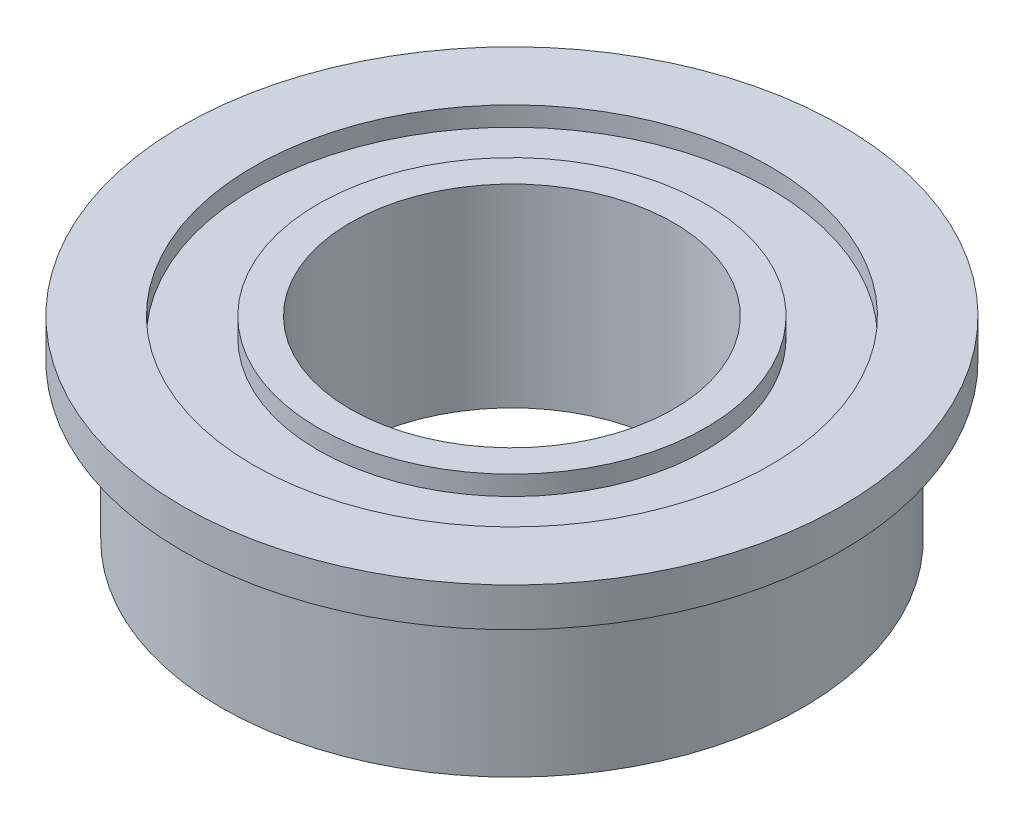
ISO-10303-21;
HEADER;
FILE_DESCRIPTION(('STEP AP214'),'2;1');
FILE_NAME('part.step','',(''),(''),'','','');
FILE_SCHEMA(('AUTOMOTIVE_DESIGN { 1 0 10303 214 1 1 1 1 }'));
ENDSEC;
DATA;
#1=APPLICATION_CONTEXT('core data for automotive mechanical design processes');
#2=APPLICATION_PROTOCOL_DEFINITION('international standard','automotive_design',2000,#1);
#3=PRODUCT_CONTEXT('',#1,'mechanical');
#4=PRODUCT('Part','Part','',(#3));
#5=PRODUCT_RELATED_PRODUCT_CATEGORY('part','',(#4));
#6=PRODUCT_DEFINITION_FORMATION('','',#4);
#7=PRODUCT_DEFINITION_CONTEXT('part definition',#1,'design');
#8=PRODUCT_DEFINITION('design','',#6,#7);
#9=PRODUCT_DEFINITION_SHAPE('','',#8);
#10=(LENGTH_UNIT() NAMED_UNIT(*) SI_UNIT(.MILLI.,.METRE.));
#11=(NAMED_UNIT(*) PLANE_ANGLE_UNIT() SI_UNIT($,.RADIAN.));
#12=(NAMED_UNIT(*) SI_UNIT($,.STERADIAN.) SOLID_ANGLE_UNIT());
#13=UNCERTAINTY_MEASURE_WITH_UNIT(LENGTH_MEASURE(1.E-05),#10,'distance_accuracy_value','');
#14=(GEOMETRIC_REPRESENTATION_CONTEXT(3) GLOBAL_UNCERTAINTY_ASSIGNED_CONTEXT((#13)) GLOBAL_UNIT_ASSIGNED_CONTEXT((#10,
#11,#12)) REPRESENTATION_CONTEXT('',''));
#15=CARTESIAN_POINT('',(0.,0.,0.));
#16=DIRECTION('',(0.,0.,1.));
#17=DIRECTION('',(1.,0.,0.));
#18=AXIS2_PLACEMENT_3D('',#15,#16,#17);
#19=CARTESIAN_POINT('',(0.,-1.5,0.));
#20=DIRECTION('',(0.,1.,0.));
#21=DIRECTION('',(0.,0.,1.));
#22=AXIS2_PLACEMENT_3D('',#19,#20,#21);
#23=CYLINDRICAL_SURFACE('',#22,4.5);
#24=CARTESIAN_POINT('',(0.,-1.5,0.));
#25=DIRECTION('',(0.,1.,0.));
#26=DIRECTION('',(0.,0.,1.));
#27=AXIS2_PLACEMENT_3D('',#24,#25,#26);
#28=CIRCLE('',#27,4.5);
#29=CARTESIAN_POINT('',(0.,-1.5,4.5));
#30=VERTEX_POINT('',#29);
#31=EDGE_CURVE('E56',#30,#30,#28,.T.);
#32=ORIENTED_EDGE('',*,*,#31,.T.);
#33=EDGE_LOOP('',(#32));
#34=FACE_BOUND('',#33,.T.);
#35=CARTESIAN_POINT('',(0.,0.9,0.));
#36=DIRECTION('',(0.,1.,0.));
#37=DIRECTION('',(0.,0.,1.));
#38=AXIS2_PLACEMENT_3D('',#35,#36,#37);
#39=CIRCLE('',#38,4.5);
#40=CARTESIAN_POINT('',(0.,0.9,4.5));
#41=VERTEX_POINT('',#40);
#42=EDGE_CURVE('E94',#41,#41,#39,.T.);
#43=ORIENTED_EDGE('',*,*,#42,.F.);
#44=EDGE_LOOP('',(#43));
#45=FACE_BOUND('',#44,.T.);
#46=ADVANCED_FACE('F49',(#34,#45),#23,.T.);
#47=CARTESIAN_POINT('',(0.,-1.5,0.));
#48=DIRECTION('',(0.,1.,0.));
#49=DIRECTION('',(0.,0.,1.));
#50=AXIS2_PLACEMENT_3D('',#47,#48,#49);
#51=CYLINDRICAL_SURFACE('',#50,4.);
#52=CARTESIAN_POINT('',(0.,-1.5,0.));
#53=DIRECTION('',(0.,1.,0.));
#54=DIRECTION('',(0.,0.,1.));
#55=AXIS2_PLACEMENT_3D('',#52,#53,#54);
#56=CIRCLE('',#55,4.);
#57=CARTESIAN_POINT('',(0.,-1.5,4.));
#58=VERTEX_POINT('',#57);
#59=EDGE_CURVE('E60',#58,#58,#56,.T.);
#60=ORIENTED_EDGE('',*,*,#59,.F.);
#61=EDGE_LOOP('',(#60));
#62=FACE_BOUND('',#61,.T.);
#63=CARTESIAN_POINT('',(0.,-1.2,0.));
#64=DIRECTION('',(0.,1.,0.));
#65=DIRECTION('',(0.,0.,1.));
#66=AXIS2_PLACEMENT_3D('',#63,#64,#65);
#67=CIRCLE('',#66,4.);
#68=CARTESIAN_POINT('',(0.,-1.2,4.));
#69=VERTEX_POINT('',#68);
#70=EDGE_CURVE('E11',#69,#69,#67,.F.);
#71=ORIENTED_EDGE('',*,*,#70,.F.);
#72=EDGE_LOOP('',(#71));
#73=FACE_BOUND('',#72,.T.);
#74=ADVANCED_FACE('F104',(#62,#73),#51,.F.);
#75=CARTESIAN_POINT('',(0.,1.2,0.));
#76=DIRECTION('',(0.,1.,0.));
#77=DIRECTION('',(0.,0.,1.));
#78=AXIS2_PLACEMENT_3D('',#75,#76,#77);
#79=CIRCLE('',#78,4.);
#80=CARTESIAN_POINT('',(0.,1.2,4.));
#81=VERTEX_POINT('',#80);
#82=EDGE_CURVE('E69',#81,#81,#79,.T.);
#83=ORIENTED_EDGE('',*,*,#82,.F.);
#84=EDGE_LOOP('',(#83));
#85=FACE_BOUND('',#84,.T.);
#86=CARTESIAN_POINT('',(0.,1.5,0.));
#87=DIRECTION('',(0.,1.,0.));
#88=DIRECTION('',(0.,0.,1.));
#89=AXIS2_PLACEMENT_3D('',#86,#87,#88);
#90=CIRCLE('',#89,4.);
#91=CARTESIAN_POINT('',(0.,1.5,4.));
#92=VERTEX_POINT('',#91);
#93=EDGE_CURVE('E64',#92,#92,#90,.T.);
#94=ORIENTED_EDGE('',*,*,#93,.T.);
#95=EDGE_LOOP('',(#94));
#96=FACE_BOUND('',#95,.T.);
#97=ADVANCED_FACE('F51',(#85,#96),#51,.F.);
#98=CARTESIAN_POINT('',(0.,-1.5,0.));
#99=DIRECTION('',(0.,1.,0.));
#100=DIRECTION('',(0.,0.,1.));
#101=AXIS2_PLACEMENT_3D('',#98,#99,#100);
#102=PLANE('',#101);
#103=ORIENTED_EDGE('',*,*,#59,.T.);
#104=EDGE_LOOP('',(#103));
#105=FACE_BOUND('',#104,.T.);
#106=ORIENTED_EDGE('',*,*,#31,.F.);
#107=EDGE_LOOP('',(#106));
#108=FACE_BOUND('',#107,.T.);
#109=ADVANCED_FACE('F112',(#105,#108),#102,.F.);
#110=CARTESIAN_POINT('',(0.,1.5,0.));
#111=DIRECTION('',(0.,1.,0.));
#112=DIRECTION('',(0.,0.,1.));
#113=AXIS2_PLACEMENT_3D('',#110,#111,#112);
#114=PLANE('',#113);
#115=ORIENTED_EDGE('',*,*,#93,.F.);
#116=EDGE_LOOP('',(#115));
#117=FACE_BOUND('',#116,.T.);
#118=CARTESIAN_POINT('',(0.,1.5,0.));
#119=DIRECTION('',(0.,1.,0.));
#120=DIRECTION('',(0.,0.,1.));
#121=AXIS2_PLACEMENT_3D('',#118,#119,#120);
#122=CIRCLE('',#121,5.1);
#123=CARTESIAN_POINT('',(0.,1.5,5.1));
#124=VERTEX_POINT('',#123);
#125=EDGE_CURVE('E91',#124,#124,#122,.T.);
#126=ORIENTED_EDGE('',*,*,#125,.T.);
#127=EDGE_LOOP('',(#126));
#128=FACE_BOUND('',#127,.T.);
#129=ADVANCED_FACE('F115',(#117,#128),#114,.T.);
#130=CARTESIAN_POINT('',(0.,-1.2,0.));
#131=DIRECTION('',(0.,1.,0.));
#132=DIRECTION('',(0.,0.,1.));
#133=AXIS2_PLACEMENT_3D('',#130,#131,#132);
#134=PLANE('',#133);
#135=CARTESIAN_POINT('',(0.,-1.2,0.));
#136=DIRECTION('',(0.,1.,0.));
#137=DIRECTION('',(0.,0.,1.));
#138=AXIS2_PLACEMENT_3D('',#135,#136,#137);
#139=CIRCLE('',#138,3.);
#140=CARTESIAN_POINT('',(0.,-1.2,3.));
#141=VERTEX_POINT('',#140);
#142=EDGE_CURVE('E75',#141,#141,#139,.T.);
#143=ORIENTED_EDGE('',*,*,#142,.T.);
#144=EDGE_LOOP('',(#143));
#145=FACE_BOUND('',#144,.T.);
#146=ORIENTED_EDGE('',*,*,#70,.T.);
#147=EDGE_LOOP('',(#146));
#148=FACE_BOUND('',#147,.T.);
#149=ADVANCED_FACE('F119',(#145,#148),#134,.F.);
#150=CARTESIAN_POINT('',(0.,1.2,0.));
#151=DIRECTION('',(0.,1.,0.));
#152=DIRECTION('',(0.,0.,1.));
#153=AXIS2_PLACEMENT_3D('',#150,#151,#152);
#154=PLANE('',#153);
#155=ORIENTED_EDGE('',*,*,#82,.T.);
#156=EDGE_LOOP('',(#155));
#157=FACE_BOUND('',#156,.T.);
#158=CARTESIAN_POINT('',(0.,1.2,0.));
#159=DIRECTION('',(0.,1.,0.));
#160=DIRECTION('',(0.,0.,1.));
#161=AXIS2_PLACEMENT_3D('',#158,#159,#160);
#162=CIRCLE('',#161,3.);
#163=CARTESIAN_POINT('',(0.,1.2,3.));
#164=VERTEX_POINT('',#163);
#165=EDGE_CURVE('E72',#164,#164,#162,.T.);
#166=ORIENTED_EDGE('',*,*,#165,.F.);
#167=EDGE_LOOP('',(#166));
#168=FACE_BOUND('',#167,.T.);
#169=ADVANCED_FACE('F123',(#157,#168),#154,.T.);
#170=CARTESIAN_POINT('',(0.,-1.5,0.));
#171=DIRECTION('',(0.,1.,0.));
#172=DIRECTION('',(0.,0.,1.));
#173=AXIS2_PLACEMENT_3D('',#170,#171,#172);
#174=CYLINDRICAL_SURFACE('',#173,3.);
#175=CARTESIAN_POINT('',(0.,-1.5,0.));
#176=DIRECTION('',(0.,1.,0.));
#177=DIRECTION('',(0.,0.,1.));
#178=AXIS2_PLACEMENT_3D('',#175,#176,#177);
#179=CIRCLE('',#178,3.);
#180=CARTESIAN_POINT('',(0.,-1.5,3.));
#181=VERTEX_POINT('',#180);
#182=EDGE_CURVE('E78',#181,#181,#179,.T.);
#183=ORIENTED_EDGE('',*,*,#182,.T.);
#184=EDGE_LOOP('',(#183));
#185=FACE_BOUND('',#184,.T.);
#186=ORIENTED_EDGE('',*,*,#142,.F.);
#187=EDGE_LOOP('',(#186));
#188=FACE_BOUND('',#187,.T.);
#189=ADVANCED_FACE('F127',(#185,#188),#174,.T.);
#190=CARTESIAN_POINT('',(0.,-1.5,0.));
#191=DIRECTION('',(0.,1.,0.));
#192=DIRECTION('',(0.,0.,1.));
#193=AXIS2_PLACEMENT_3D('',#190,#191,#192);
#194=CYLINDRICAL_SURFACE('',#193,2.5);
#195=CARTESIAN_POINT('',(0.,-1.5,0.));
#196=DIRECTION('',(0.,1.,0.));
#197=DIRECTION('',(0.,0.,1.));
#198=AXIS2_PLACEMENT_3D('',#195,#196,#197);
#199=CIRCLE('',#198,2.5);
#200=CARTESIAN_POINT('',(0.,-1.5,2.5));
#201=VERTEX_POINT('',#200);
#202=EDGE_CURVE('E81',#201,#201,#199,.T.);
#203=ORIENTED_EDGE('',*,*,#202,.F.);
#204=EDGE_LOOP('',(#203));
#205=FACE_BOUND('',#204,.T.);
#206=CARTESIAN_POINT('',(0.,1.5,0.));
#207=DIRECTION('',(0.,1.,0.));
#208=DIRECTION('',(0.,0.,1.));
#209=AXIS2_PLACEMENT_3D('',#206,#207,#208);
#210=CIRCLE('',#209,2.5);
#211=CARTESIAN_POINT('',(0.,1.5,2.5));
#212=VERTEX_POINT('',#211);
#213=EDGE_CURVE('E87',#212,#212,#210,.T.);
#214=ORIENTED_EDGE('',*,*,#213,.T.);
#215=EDGE_LOOP('',(#214));
#216=FACE_BOUND('',#215,.T.);
#217=ADVANCED_FACE('F129',(#205,#216),#194,.F.);
#218=ORIENTED_EDGE('',*,*,#165,.T.);
#219=EDGE_LOOP('',(#218));
#220=FACE_BOUND('',#219,.T.);
#221=CARTESIAN_POINT('',(0.,1.5,0.));
#222=DIRECTION('',(0.,1.,0.));
#223=DIRECTION('',(0.,0.,1.));
#224=AXIS2_PLACEMENT_3D('',#221,#222,#223);
#225=CIRCLE('',#224,3.);
#226=CARTESIAN_POINT('',(0.,1.5,3.));
#227=VERTEX_POINT('',#226);
#228=EDGE_CURVE('E84',#227,#227,#225,.T.);
#229=ORIENTED_EDGE('',*,*,#228,.F.);
#230=EDGE_LOOP('',(#229));
#231=FACE_BOUND('',#230,.T.);
#232=ADVANCED_FACE('F132',(#220,#231),#174,.T.);
#233=CARTESIAN_POINT('',(0.,-1.5,0.));
#234=DIRECTION('',(0.,1.,0.));
#235=DIRECTION('',(0.,0.,1.));
#236=AXIS2_PLACEMENT_3D('',#233,#234,#235);
#237=PLANE('',#236);
#238=ORIENTED_EDGE('',*,*,#202,.T.);
#239=EDGE_LOOP('',(#238));
#240=FACE_BOUND('',#239,.T.);
#241=ORIENTED_EDGE('',*,*,#182,.F.);
#242=EDGE_LOOP('',(#241));
#243=FACE_BOUND('',#242,.T.);
#244=ADVANCED_FACE('F136',(#240,#243),#237,.F.);
#245=CARTESIAN_POINT('',(0.,1.5,0.));
#246=DIRECTION('',(0.,1.,0.));
#247=DIRECTION('',(0.,0.,1.));
#248=AXIS2_PLACEMENT_3D('',#245,#246,#247);
#249=PLANE('',#248);
#250=ORIENTED_EDGE('',*,*,#213,.F.);
#251=EDGE_LOOP('',(#250));
#252=FACE_BOUND('',#251,.T.);
#253=ORIENTED_EDGE('',*,*,#228,.T.);
#254=EDGE_LOOP('',(#253));
#255=FACE_BOUND('',#254,.T.);
#256=ADVANCED_FACE('F140',(#252,#255),#249,.T.);
#257=CARTESIAN_POINT('',(0.,0.9,0.));
#258=DIRECTION('',(0.,1.,0.));
#259=DIRECTION('',(0.,0.,1.));
#260=AXIS2_PLACEMENT_3D('',#257,#258,#259);
#261=CYLINDRICAL_SURFACE('',#260,5.1);
#262=CARTESIAN_POINT('',(0.,0.9,0.));
#263=DIRECTION('',(0.,1.,0.));
#264=DIRECTION('',(0.,0.,1.));
#265=AXIS2_PLACEMENT_3D('',#262,#263,#264);
#266=CIRCLE('',#265,5.1);
#267=CARTESIAN_POINT('',(0.,0.9,5.1));
#268=VERTEX_POINT('',#267);
#269=EDGE_CURVE('E90',#268,#268,#266,.T.);
#270=ORIENTED_EDGE('',*,*,#269,.T.);
#271=EDGE_LOOP('',(#270));
#272=FACE_BOUND('',#271,.T.);
#273=ORIENTED_EDGE('',*,*,#125,.F.);
#274=EDGE_LOOP('',(#273));
#275=FACE_BOUND('',#274,.T.);
#276=ADVANCED_FACE('F144',(#272,#275),#261,.T.);
#277=CARTESIAN_POINT('',(0.,0.9,0.));
#278=DIRECTION('',(0.,1.,0.));
#279=DIRECTION('',(0.,0.,1.));
#280=AXIS2_PLACEMENT_3D('',#277,#278,#279);
#281=PLANE('',#280);
#282=ORIENTED_EDGE('',*,*,#42,.T.);
#283=EDGE_LOOP('',(#282));
#284=FACE_BOUND('',#283,.T.);
#285=ORIENTED_EDGE('',*,*,#269,.F.);
#286=EDGE_LOOP('',(#285));
#287=FACE_BOUND('',#286,.T.);
#288=ADVANCED_FACE('F100',(#284,#287),#281,.F.);
#289=CLOSED_SHELL('',(#46,#74,#97,#109,#129,#149,#169,#189,#217,#232,#244,#256,#276,#288));
#290=MANIFOLD_SOLID_BREP('B2',#289);
#291=ADVANCED_BREP_SHAPE_REPRESENTATION('',(#18,#290),#14);
#292=SHAPE_DEFINITION_REPRESENTATION(#9,#291);
ENDSEC;
END-ISO-10303-21;
